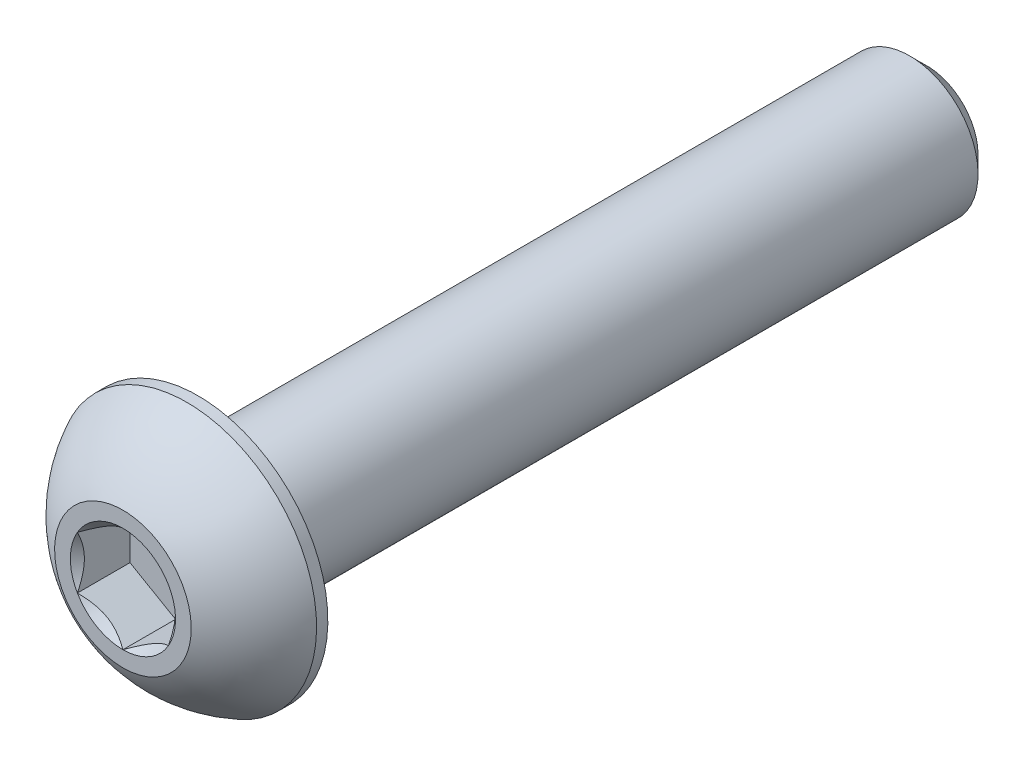
ISO-10303-21;
HEADER;
FILE_DESCRIPTION(('STEP AP214'),'2;1');
FILE_NAME('part.step','',(''),(''),'','','');
FILE_SCHEMA(('AUTOMOTIVE_DESIGN { 1 0 10303 214 1 1 1 1 }'));
ENDSEC;
DATA;
#1=APPLICATION_CONTEXT('core data for automotive mechanical design processes');
#2=APPLICATION_PROTOCOL_DEFINITION('international standard','automotive_design',2000,#1);
#3=PRODUCT_CONTEXT('',#1,'mechanical');
#4=PRODUCT('Part','Part','',(#3));
#5=PRODUCT_RELATED_PRODUCT_CATEGORY('part','',(#4));
#6=PRODUCT_DEFINITION_FORMATION('','',#4);
#7=PRODUCT_DEFINITION_CONTEXT('part definition',#1,'design');
#8=PRODUCT_DEFINITION('design','',#6,#7);
#9=PRODUCT_DEFINITION_SHAPE('','',#8);
#10=(LENGTH_UNIT() NAMED_UNIT(*) SI_UNIT(.MILLI.,.METRE.));
#11=(NAMED_UNIT(*) PLANE_ANGLE_UNIT() SI_UNIT($,.RADIAN.));
#12=(NAMED_UNIT(*) SI_UNIT($,.STERADIAN.) SOLID_ANGLE_UNIT());
#13=UNCERTAINTY_MEASURE_WITH_UNIT(LENGTH_MEASURE(1.E-05),#10,'distance_accuracy_value','');
#14=(GEOMETRIC_REPRESENTATION_CONTEXT(3) GLOBAL_UNCERTAINTY_ASSIGNED_CONTEXT((#13)) GLOBAL_UNIT_ASSIGNED_CONTEXT((#10,
#11,#12)) REPRESENTATION_CONTEXT('',''));
#15=CARTESIAN_POINT('',(0.,0.,0.));
#16=DIRECTION('',(0.,0.,1.));
#17=DIRECTION('',(1.,0.,0.));
#18=AXIS2_PLACEMENT_3D('',#15,#16,#17);
#19=CARTESIAN_POINT('',(0.,0.,-8.));
#20=DIRECTION('',(0.,0.,1.));
#21=DIRECTION('',(0.,-1.,0.));
#22=AXIS2_PLACEMENT_3D('',#19,#20,#21);
#23=PLANE('',#22);
#24=CARTESIAN_POINT('',(0.,0.,-8.));
#25=DIRECTION('',(0.,0.,1.));
#26=DIRECTION('',(0.,-1.,0.));
#27=AXIS2_PLACEMENT_3D('',#24,#25,#26);
#28=CIRCLE('',#27,1.12499999999998);
#29=CARTESIAN_POINT('',(0.,-1.12499999999997,-8.));
#30=VERTEX_POINT('',#29);
#31=EDGE_CURVE('E57',#30,#30,#28,.T.);
#32=ORIENTED_EDGE('',*,*,#31,.F.);
#33=EDGE_LOOP('',(#32));
#34=FACE_BOUND('',#33,.T.);
#35=ADVANCED_FACE('F43',(#34),#23,.F.);
#36=CARTESIAN_POINT('',(0.,0.,-8.));
#37=DIRECTION('',(0.,0.,1.));
#38=DIRECTION('',(0.,-1.,0.));
#39=AXIS2_PLACEMENT_3D('',#36,#37,#38);
#40=CONICAL_SURFACE('',#39,1.12499999999998,0.785398163397446);
#41=CARTESIAN_POINT('',(0.,0.,-7.625));
#42=DIRECTION('',(0.,0.,1.));
#43=DIRECTION('',(0.,-1.,0.));
#44=AXIS2_PLACEMENT_3D('',#41,#42,#43);
#45=CIRCLE('',#44,1.49999999999998);
#46=CARTESIAN_POINT('',(0.,-1.49999999999997,-7.625));
#47=VERTEX_POINT('',#46);
#48=EDGE_CURVE('E207',#47,#47,#45,.T.);
#49=ORIENTED_EDGE('',*,*,#48,.F.);
#50=EDGE_LOOP('',(#49));
#51=FACE_BOUND('',#50,.T.);
#52=ORIENTED_EDGE('',*,*,#31,.T.);
#53=EDGE_LOOP('',(#52));
#54=FACE_BOUND('',#53,.T.);
#55=ADVANCED_FACE('F214',(#51,#54),#40,.T.);
#56=CARTESIAN_POINT('',(0.,0.,9.65));
#57=DIRECTION('',(0.,0.,1.));
#58=DIRECTION('',(0.,-1.,0.));
#59=AXIS2_PLACEMENT_3D('',#56,#57,#58);
#60=CYLINDRICAL_SURFACE('',#59,1.49999999999999);
#61=CARTESIAN_POINT('',(0.,0.,8.));
#62=DIRECTION('',(0.,0.,1.));
#63=DIRECTION('',(0.,-1.,0.));
#64=AXIS2_PLACEMENT_3D('',#61,#62,#63);
#65=CIRCLE('',#64,1.5);
#66=CARTESIAN_POINT('',(0.,-1.5,8.));
#67=VERTEX_POINT('',#66);
#68=EDGE_CURVE('E203',#67,#67,#65,.T.);
#69=ORIENTED_EDGE('',*,*,#68,.F.);
#70=EDGE_LOOP('',(#69));
#71=FACE_BOUND('',#70,.T.);
#72=ORIENTED_EDGE('',*,*,#48,.T.);
#73=EDGE_LOOP('',(#72));
#74=FACE_BOUND('',#73,.T.);
#75=ADVANCED_FACE('F220',(#71,#74),#60,.T.);
#76=CARTESIAN_POINT('',(0.,-2.85000000000001,8.));
#77=DIRECTION('',(0.,0.,1.));
#78=DIRECTION('',(0.,-1.,0.));
#79=AXIS2_PLACEMENT_3D('',#76,#77,#78);
#80=PLANE('',#79);
#81=CARTESIAN_POINT('',(0.,0.,8.));
#82=DIRECTION('',(0.,0.,1.));
#83=DIRECTION('',(0.,-1.,0.));
#84=AXIS2_PLACEMENT_3D('',#81,#82,#83);
#85=CIRCLE('',#84,2.85000000000001);
#86=CARTESIAN_POINT('',(0.,-2.85000000000001,8.));
#87=VERTEX_POINT('',#86);
#88=EDGE_CURVE('E195',#87,#87,#85,.T.);
#89=ORIENTED_EDGE('',*,*,#88,.F.);
#90=EDGE_LOOP('',(#89));
#91=FACE_BOUND('',#90,.T.);
#92=ORIENTED_EDGE('',*,*,#68,.T.);
#93=EDGE_LOOP('',(#92));
#94=FACE_BOUND('',#93,.T.);
#95=ADVANCED_FACE('F225',(#91,#94),#80,.F.);
#96=CARTESIAN_POINT('',(0.,0.,6.85516711229947));
#97=DIRECTION('',(0.,0.,1.));
#98=DIRECTION('',(0.,-1.,0.));
#99=AXIS2_PLACEMENT_3D('',#96,#97,#98);
#100=SPHERICAL_SURFACE('',#99,3.17192226735973);
#101=CARTESIAN_POINT('',(0.,0.,9.65));
#102=DIRECTION('',(0.,0.,1.));
#103=DIRECTION('',(0.,-1.,0.));
#104=AXIS2_PLACEMENT_3D('',#101,#102,#103);
#105=CIRCLE('',#104,1.50000000000001);
#106=CARTESIAN_POINT('',(0.,-1.50000000000001,9.65));
#107=VERTEX_POINT('',#106);
#108=EDGE_CURVE('E199',#107,#107,#105,.T.);
#109=CARTESIAN_POINT('',(0.,0.,8.2475));
#110=DIRECTION('',(0.,0.,1.));
#111=DIRECTION('',(0.,-1.,0.));
#112=AXIS2_PLACEMENT_3D('',#109,#110,#111);
#113=CIRCLE('',#112,2.85000000000001);
#114=CARTESIAN_POINT('',(0.,-2.85000000000001,8.2475));
#115=VERTEX_POINT('',#114);
#116=EDGE_CURVE('E191',#115,#115,#113,.T.);
#117=CARTESIAN_POINT('',(0.,-1.50000000000001,9.65));
#118=CARTESIAN_POINT('',(0.,-1.51816007989211,9.64025343052663));
#119=CARTESIAN_POINT('',(0.,-1.53622513742981,9.63032981527615));
#120=CARTESIAN_POINT('',(0.,-1.57215840256595,9.61013236887069));
#121=CARTESIAN_POINT('',(0.,-1.59002661016438,9.59985853771571));
#122=CARTESIAN_POINT('',(0.,-1.62555937019151,9.57896453515098));
#123=CARTESIAN_POINT('',(0.,-1.6432239226202,9.56834436374123));
#124=CARTESIAN_POINT('',(0.,-1.67834266450263,9.54676172357303));
#125=CARTESIAN_POINT('',(0.,-1.69579685395636,9.53579925481459));
#126=CARTESIAN_POINT('',(0.,-1.73048823664555,9.51353618336439));
#127=CARTESIAN_POINT('',(0.,-1.74772542988099,9.50223558067265));
#128=CARTESIAN_POINT('',(0.,-1.78197627078177,9.47930053581285));
#129=CARTESIAN_POINT('',(0.,-1.7989899184471,9.46766609364478));
#130=CARTESIAN_POINT('',(0.,-1.83278720341136,9.44406779045309));
#131=CARTESIAN_POINT('',(0.,-1.84957084071029,9.43210392942946));
#132=CARTESIAN_POINT('',(0.,-1.88290172764637,9.40785133450125));
#133=CARTESIAN_POINT('',(0.,-1.89944897728351,9.39556260059666));
#134=CARTESIAN_POINT('',(0.,-1.9323008013937,9.37066492927458));
#135=CARTESIAN_POINT('',(0.,-1.94860537586674,9.35805599185708));
#136=CARTESIAN_POINT('',(0.,-1.98096565436366,9.33252270455889));
#137=CARTESIAN_POINT('',(0.,-1.99702135838754,9.31959835467819));
#138=CARTESIAN_POINT('',(0.,-2.02887779526297,9.29343915334777));
#139=CARTESIAN_POINT('',(0.,-2.04467852811453,9.28020430189805));
#140=CARTESIAN_POINT('',(0.,-2.07601901880465,9.25342912630669));
#141=CARTESIAN_POINT('',(0.,-2.09155877664322,9.23988880216506));
#142=CARTESIAN_POINT('',(0.,-2.12237141262986,9.21250782613789));
#143=CARTESIAN_POINT('',(0.,-2.13764429077793,9.19866717425237));
#144=CARTESIAN_POINT('',(0.,-2.16791736411297,9.17069080180173));
#145=CARTESIAN_POINT('',(0.,-2.18291755929994,9.15655508123662));
#146=CARTESIAN_POINT('',(0.,-2.21263956705415,9.12799394260905));
#147=CARTESIAN_POINT('',(0.,-2.2273613796214,9.11356852454658));
#148=CARTESIAN_POINT('',(0.,-2.25652102825521,9.08443347218353));
#149=CARTESIAN_POINT('',(0.,-2.27095886432178,9.06972383788295));
#150=CARTESIAN_POINT('',(0.,-2.29954507397651,9.04002594229721));
#151=CARTESIAN_POINT('',(0.,-2.31369344756466,9.02503768101205));
#152=CARTESIAN_POINT('',(0.,-2.34169535627253,8.99478822658124));
#153=CARTESIAN_POINT('',(0.,-2.35554889139224,8.97952703343559));
#154=CARTESIAN_POINT('',(0.,-2.38295585920367,8.94873751411442));
#155=CARTESIAN_POINT('',(0.,-2.39650929189538,8.93320918793889));
#156=CARTESIAN_POINT('',(0.,-2.42331090492183,8.90189130289176));
#157=CARTESIAN_POINT('',(0.,-2.43655908525657,8.88610174402014));
#158=CARTESIAN_POINT('',(0.,-2.46274515962756,8.85426739317577));
#159=CARTESIAN_POINT('',(0.,-2.4756830536638,8.83822260120302));
#160=CARTESIAN_POINT('',(0.,-2.50124363939651,8.80588388073287));
#161=CARTESIAN_POINT('',(0.,-2.51386633109299,8.78958995223548));
#162=CARTESIAN_POINT('',(0.,-2.5387917158728,8.7567591499574));
#163=CARTESIAN_POINT('',(0.,-2.55109440895613,8.74022227617671));
#164=CARTESIAN_POINT('',(0.,-2.57537512182786,8.70691186688636));
#165=CARTESIAN_POINT('',(0.,-2.58735314161626,8.69013833137669));
#166=CARTESIAN_POINT('',(0.,-2.61097995657957,8.65636097210575));
#167=CARTESIAN_POINT('',(0.,-2.62262875175449,8.63935714834448));
#168=CARTESIAN_POINT('',(0.,-2.645592691282,8.60512567355774));
#169=CARTESIAN_POINT('',(0.,-2.65690783563459,8.58789802253229));
#170=CARTESIAN_POINT('',(0.,-2.6792001740364,8.55322543922701));
#171=CARTESIAN_POINT('',(0.,-2.69017736808562,8.53578050694718));
#172=CARTESIAN_POINT('',(0.,-2.71178963499901,8.50067998980005));
#173=CARTESIAN_POINT('',(0.,-2.72242470786317,8.48302440493274));
#174=CARTESIAN_POINT('',(0.,-2.74334869082118,8.44750929096057));
#175=CARTESIAN_POINT('',(0.,-2.75363760091503,8.4296497618557));
#176=CARTESIAN_POINT('',(0.,-2.77386535089242,8.39373354659175));
#177=CARTESIAN_POINT('',(0.,-2.78380419077597,8.37567686043267));
#178=CARTESIAN_POINT('',(0.,-2.80332801615779,8.33937318815589));
#179=CARTESIAN_POINT('',(0.,-2.81291300165606,8.32112620203818));
#180=CARTESIAN_POINT('',(0.,-2.83172550494216,8.2844488779161));
#181=CARTESIAN_POINT('',(0.,-2.84095302272999,8.26601853991173));
#182=CARTESIAN_POINT('',(0.,-2.85000000000001,8.2475));
#183=B_SPLINE_CURVE_WITH_KNOTS('',3,(#117,#118,#119,#120,#121,#122,#123,#124,#125,#126,#127,
#128,#129,#130,#131,#132,#133,#134,#135,#136,#137,#138,#139,#140,#141,#142,#143,#144,#145,#146,
#147,#148,#149,#150,#151,#152,#153,#154,#155,#156,#157,#158,#159,#160,#161,#162,#163,#164,#165,
#166,#167,#168,#169,#170,#171,#172,#173,#174,#175,#176,#177,#178,#179,#180,#181,#182),
.UNSPECIFIED.,.F.,.F.,(4,2,2,2,2,2,2,2,2,2,2,2,2,2,2,2,2,2,2,2,2,2,2,2,2,2,2,2,2,2,2,2,4),(0.,
0.0618298941826991,0.123659788365397,0.185489682548095,0.247319576730794,0.309149470913492,
0.37097936509619,0.432809259278889,0.494639153461587,0.556469047644286,0.618298941826984,
0.680128836009683,0.741958730192381,0.80378862437508,0.865618518557778,0.927448412740476,
0.989278306923174,1.05110820110587,1.11293809528857,1.17476798947127,1.23659788365397,
1.29842777783667,1.36025767201936,1.42208756620206,1.48391746038476,1.54574735456746,
1.60757724875016,1.66940714293286,1.73123703711555,1.79306693129825,1.85489682548095,
1.91672671966365,1.97855661384635),.UNSPECIFIED.);
#184=EDGE_CURVE('BSEAM230',#107,#115,#183,.T.);
#185=ORIENTED_EDGE('',*,*,#108,.F.);
#186=ORIENTED_EDGE('',*,*,#116,.T.);
#187=ORIENTED_EDGE('',*,*,#184,.T.);
#188=ORIENTED_EDGE('',*,*,#184,.F.);
#189=EDGE_LOOP('',(#185,#187,#186,#188));
#190=FACE_BOUND('',#189,.T.);
#191=ADVANCED_FACE('F230',(#190),#100,.T.);
#192=CARTESIAN_POINT('',(0.,-1.50000000000001,9.65));
#193=DIRECTION('',(0.,0.,-1.));
#194=DIRECTION('',(0.,1.,0.));
#195=AXIS2_PLACEMENT_3D('',#192,#193,#194);
#196=PLANE('',#195);
#197=CARTESIAN_POINT('',(0.,0.,9.65));
#198=DIRECTION('',(0.,0.,1.));
#199=DIRECTION('',(1.,0.,0.));
#200=AXIS2_PLACEMENT_3D('',#197,#198,#199);
#201=CIRCLE('',#200,1.15470053837926);
#202=CARTESIAN_POINT('',(0.,1.15470053837925,9.65));
#203=VERTEX_POINT('',#202);
#204=CARTESIAN_POINT('',(-1.00000000000001,0.577350269189621,9.65));
#205=VERTEX_POINT('',#204);
#206=EDGE_CURVE('E148',#203,#205,#201,.T.);
#207=ORIENTED_EDGE('',*,*,#206,.F.);
#208=CARTESIAN_POINT('',(1.00000000000001,0.577350269189622,9.65));
#209=VERTEX_POINT('',#208);
#210=EDGE_CURVE('E143',#209,#203,#201,.T.);
#211=ORIENTED_EDGE('',*,*,#210,.F.);
#212=CARTESIAN_POINT('',(1.00000000000001,-0.577350269189636,9.65));
#213=VERTEX_POINT('',#212);
#214=EDGE_CURVE('E111',#213,#209,#201,.T.);
#215=ORIENTED_EDGE('',*,*,#214,.F.);
#216=CARTESIAN_POINT('',(0.,-1.15470053837927,9.65));
#217=VERTEX_POINT('',#216);
#218=EDGE_CURVE('E102',#217,#213,#201,.T.);
#219=ORIENTED_EDGE('',*,*,#218,.F.);
#220=CARTESIAN_POINT('',(-1.00000000000001,-0.577350269189636,9.65));
#221=VERTEX_POINT('',#220);
#222=EDGE_CURVE('E63',#221,#217,#201,.T.);
#223=ORIENTED_EDGE('',*,*,#222,.F.);
#224=EDGE_CURVE('E70',#205,#221,#201,.T.);
#225=ORIENTED_EDGE('',*,*,#224,.F.);
#226=EDGE_LOOP('',(#207,#211,#215,#219,#223,#225));
#227=FACE_BOUND('',#226,.T.);
#228=ORIENTED_EDGE('',*,*,#108,.T.);
#229=EDGE_LOOP('',(#228));
#230=FACE_BOUND('',#229,.T.);
#231=ADVANCED_FACE('F140',(#227,#230),#196,.F.);
#232=CARTESIAN_POINT('',(0.,0.,9.65));
#233=DIRECTION('',(0.,0.,1.));
#234=DIRECTION('',(0.,-1.,0.));
#235=AXIS2_PLACEMENT_3D('',#232,#233,#234);
#236=CYLINDRICAL_SURFACE('',#235,2.85000000000001);
#237=ORIENTED_EDGE('',*,*,#116,.F.);
#238=EDGE_LOOP('',(#237));
#239=FACE_BOUND('',#238,.T.);
#240=ORIENTED_EDGE('',*,*,#88,.T.);
#241=EDGE_LOOP('',(#240));
#242=FACE_BOUND('',#241,.T.);
#243=ADVANCED_FACE('F236',(#239,#242),#236,.T.);
#244=CARTESIAN_POINT('',(0.,0.,9.65));
#245=DIRECTION('',(0.,0.,1.));
#246=DIRECTION('',(1.,0.,0.));
#247=AXIS2_PLACEMENT_3D('',#244,#245,#246);
#248=CONICAL_SURFACE('',#247,1.15470053837926,0.78539816339745);
#249=ORIENTED_EDGE('',*,*,#214,.T.);
#250=CARTESIAN_POINT('',(1.00000000000001,-1.15147208663216,10.0203856776404));
#251=CARTESIAN_POINT('',(1.00000000000001,-1.12343448004837,9.99921991999533));
#252=CARTESIAN_POINT('',(1.00000000000001,-1.0952406486651,9.97826169229267));
#253=CARTESIAN_POINT('',(1.00000000000001,-1.03847715659241,9.93684602234268));
#254=CARTESIAN_POINT('',(1.00000000000001,-1.00990740397364,9.91638870622588));
#255=CARTESIAN_POINT('',(1.00000000000001,-0.923120894462788,9.85560479504213));
#256=CARTESIAN_POINT('',(1.00000000000001,-0.864253173878458,9.81619222903933));
#257=CARTESIAN_POINT('',(1.00000000000001,-0.740809858355824,9.73882066425819));
#258=CARTESIAN_POINT('',(1.00000000000001,-0.676100255223821,9.70107303916216));
#259=CARTESIAN_POINT('',(1.00000000000001,-0.543448939110608,9.63202458758025));
#260=CARTESIAN_POINT('',(1.00000000000001,-0.475519112076506,9.60070202786713));
#261=CARTESIAN_POINT('',(1.00000000000001,-0.373555850372658,9.5623817788976));
#262=CARTESIAN_POINT('',(1.00000000000001,-0.341031989714056,9.55138359165622));
#263=CARTESIAN_POINT('',(1.00000000000001,-0.275199079103611,9.53199834216111));
#264=CARTESIAN_POINT('',(1.00000000000001,-0.241889975229401,9.52361145978989));
#265=CARTESIAN_POINT('',(1.00000000000001,-0.175247517106624,9.51002522073014));
#266=CARTESIAN_POINT('',(1.00000000000001,-0.141925568285816,9.50477079077761));
#267=CARTESIAN_POINT('',(1.00000000000001,-0.0749144363078094,9.49754868657667));
#268=CARTESIAN_POINT('',(1.00000000000001,-0.0412251979295709,9.49558151361391));
#269=CARTESIAN_POINT('',(1.00000000000001,0.0249580991768566,9.49508319839111));
#270=CARTESIAN_POINT('',(1.00000000000001,0.0574512825561883,9.49643026788357));
#271=CARTESIAN_POINT('',(1.00000000000001,0.122148505605771,9.50221648448742));
#272=CARTESIAN_POINT('',(1.00000000000001,0.154352610033873,9.50665492064649));
#273=CARTESIAN_POINT('',(1.00000000000001,0.218799898762748,9.51845683012285));
#274=CARTESIAN_POINT('',(1.00000000000001,0.25103374316119,9.52587054101231));
#275=CARTESIAN_POINT('',(1.00000000000001,0.314797132241688,9.54322894246471));
#276=CARTESIAN_POINT('',(1.00000000000001,0.346326735615178,9.55317342125094));
#277=CARTESIAN_POINT('',(1.00000000000001,0.445594187589159,9.58822348249794));
#278=CARTESIAN_POINT('',(1.00000000000001,0.51191913931363,9.6173208582833));
#279=CARTESIAN_POINT('',(1.00000000000001,0.641453244454046,9.68201532957715));
#280=CARTESIAN_POINT('',(1.00000000000001,0.704650132903148,9.71763577658696));
#281=CARTESIAN_POINT('',(1.00000000000001,0.825428489916352,9.79112390118245));
#282=CARTESIAN_POINT('',(1.00000000000001,0.883132947593197,9.82879194695385));
#283=CARTESIAN_POINT('',(1.00000000000001,0.968148853406637,9.88702285273595));
#284=CARTESIAN_POINT('',(1.00000000000001,0.996120570074655,9.90663847554718));
#285=CARTESIAN_POINT('',(1.00000000000001,1.05168177697803,9.94638851682867));
#286=CARTESIAN_POINT('',(1.00000000000001,1.07927136964837,9.96652279195778));
#287=CARTESIAN_POINT('',(1.00000000000001,1.10670185312702,9.98687211882347));
#288=B_SPLINE_CURVE_WITH_KNOTS('',3,(#250,#251,#252,#253,#254,#255,#256,#257,#258,#259,#260,
#261,#262,#263,#264,#265,#266,#267,#268,#269,#270,#271,#272,#273,#274,#275,#276,#277,#278,#279,
#280,#281,#282,#283,#284,#285,#286,#287),.UNSPECIFIED.,.F.,.F.,(4,2,2,2,2,2,2,2,2,2,2,2,2,2,2,2,
2,2,4),(0.,0.105386459103352,0.21079918737025,0.423233611646474,0.647793541035355,
0.87158087791087,0.97449307434206,1.07741235842105,1.17846428216996,1.2795316142844,
1.3769408675127,1.47432772596048,1.57343322813836,1.67253043981297,1.88917353997387,
2.10660791031435,2.31323734235673,2.41572589214524,2.51818641455634),.UNSPECIFIED.);
#289=EDGE_CURVE('E11',#213,#209,#288,.T.);
#290=ORIENTED_EDGE('',*,*,#289,.F.);
#291=EDGE_LOOP('',(#249,#290));
#292=FACE_BOUND('',#291,.T.);
#293=ADVANCED_FACE('F115',(#292),#248,.F.);
#294=ORIENTED_EDGE('',*,*,#210,.T.);
#295=CARTESIAN_POINT('',(1.00020000000001,0.577234799135784,9.65011548737261));
#296=CARTESIAN_POINT('',(0.965817404992825,0.597085599618617,9.63027793082573));
#297=CARTESIAN_POINT('',(0.930859881860181,0.617268335009452,9.61160502063889));
#298=CARTESIAN_POINT('',(0.859577197043916,0.658423412276682,9.57741474272316));
#299=CARTESIAN_POINT('',(0.823245249471021,0.679399671988076,9.56191640902346));
#300=CARTESIAN_POINT('',(0.749983386196693,0.721697428470842,9.53536730714226));
#301=CARTESIAN_POINT('',(0.71307214855459,0.743008141459633,9.52424977399693));
#302=CARTESIAN_POINT('',(0.638437270689145,0.786098608286183,9.50711986577618));
#303=CARTESIAN_POINT('',(0.600715911891368,0.807877044942278,9.50109469746667));
#304=CARTESIAN_POINT('',(0.53570780158207,0.84540949492886,9.49566055496749));
#305=CARTESIAN_POINT('',(0.508505628471831,0.861114676896599,9.49485693831673));
#306=CARTESIAN_POINT('',(0.454153959330891,0.892494627706026,9.49620669941689));
#307=CARTESIAN_POINT('',(0.427004476245127,0.908169389073951,9.4983607295472));
#308=CARTESIAN_POINT('',(0.345943722673042,0.954969836969508,9.50911697212847));
#309=CARTESIAN_POINT('',(0.292435859021575,0.985862616452445,9.52201455641536));
#310=CARTESIAN_POINT('',(0.19852393485657,1.04008269114923,9.55314073060218));
#311=CARTESIAN_POINT('',(0.157679476328166,1.0636642502755,9.56973779770184));
#312=CARTESIAN_POINT('',(0.0775903626180564,1.10990372163519,9.60712492468529));
#313=CARTESIAN_POINT('',(0.0383409891295622,1.1325643579843,9.6279013418174));
#314=CARTESIAN_POINT('',(-0.000200000000000446,1.15481600843309,9.65011548737261));
#315=B_SPLINE_CURVE_WITH_KNOTS('',3,(#295,#296,#297,#298,#299,#300,#301,#302,#303,#304,#305,
#306,#307,#308,#309,#310,#311,#312,#313,#314),.UNSPECIFIED.,.F.,.F.,(4,2,2,2,2,2,2,2,2,4),(0.,
0.133237676828559,0.267252229834491,0.399137076269302,0.530689603280771,0.624814864263849,
0.718960890149137,0.907306626112102,1.0571010036179,1.20641411519287),.UNSPECIFIED.);
#316=EDGE_CURVE('E147',#209,#203,#315,.T.);
#317=ORIENTED_EDGE('',*,*,#316,.F.);
#318=EDGE_LOOP('',(#294,#317));
#319=FACE_BOUND('',#318,.T.);
#320=ADVANCED_FACE('F323',(#319),#248,.F.);
#321=ORIENTED_EDGE('',*,*,#206,.T.);
#322=CARTESIAN_POINT('',(0.000199999999999627,1.15481600843309,9.65011548737261));
#323=CARTESIAN_POINT('',(-0.034182595007181,1.13496520795025,9.63027793082573));
#324=CARTESIAN_POINT('',(-0.0691401181398251,1.11478247255942,9.61160502063889));
#325=CARTESIAN_POINT('',(-0.14042280295609,1.07362739529219,9.57741474272316));
#326=CARTESIAN_POINT('',(-0.176754750528985,1.0526511355808,9.56191640902346));
#327=CARTESIAN_POINT('',(-0.250016613803312,1.01035337909803,9.53536730714226));
#328=CARTESIAN_POINT('',(-0.286927851445416,0.989042666109239,9.52424977399693));
#329=CARTESIAN_POINT('',(-0.361562729310861,0.945952199282689,9.50711986577618));
#330=CARTESIAN_POINT('',(-0.399284088108637,0.924173762626594,9.50109469746667));
#331=CARTESIAN_POINT('',(-0.464292198417936,0.886641312640012,9.49566055496749));
#332=CARTESIAN_POINT('',(-0.491494371528174,0.870936130672273,9.49485693831673));
#333=CARTESIAN_POINT('',(-0.545846040669114,0.839556179862846,9.49620669941689));
#334=CARTESIAN_POINT('',(-0.572995523754878,0.823881418494921,9.4983607295472));
#335=CARTESIAN_POINT('',(-0.654056277326963,0.777080970599364,9.50911697212847));
#336=CARTESIAN_POINT('',(-0.70756414097843,0.746188191116427,9.52201455641536));
#337=CARTESIAN_POINT('',(-0.801476065143435,0.691968116419646,9.55314073060218));
#338=CARTESIAN_POINT('',(-0.842320523671839,0.668386557293368,9.56973779770184));
#339=CARTESIAN_POINT('',(-0.922409637381949,0.622147085933677,9.60712492468529));
#340=CARTESIAN_POINT('',(-0.961659010870444,0.59948644958457,9.6279013418174));
#341=CARTESIAN_POINT('',(-1.00020000000001,0.577234799135783,9.65011548737261));
#342=B_SPLINE_CURVE_WITH_KNOTS('',3,(#322,#323,#324,#325,#326,#327,#328,#329,#330,#331,#332,
#333,#334,#335,#336,#337,#338,#339,#340,#341),.UNSPECIFIED.,.F.,.F.,(4,2,2,2,2,2,2,2,2,4),(0.,
0.133237676828559,0.267252229834491,0.399137076269301,0.53068960328077,0.624814864263848,
0.718960890149135,0.907306626112101,1.0571010036179,1.20641411519287),.UNSPECIFIED.);
#343=EDGE_CURVE('E153',#203,#205,#342,.T.);
#344=ORIENTED_EDGE('',*,*,#343,.F.);
#345=EDGE_LOOP('',(#321,#344));
#346=FACE_BOUND('',#345,.T.);
#347=ADVANCED_FACE('F158',(#346),#248,.F.);
#348=ORIENTED_EDGE('',*,*,#224,.T.);
#349=CARTESIAN_POINT('',(-1.00000000000001,-1.15147208646463,10.0203856775139));
#350=CARTESIAN_POINT('',(-1.00000000000001,-1.12343447988553,9.99921991987372));
#351=CARTESIAN_POINT('',(-1.00000000000001,-1.09524064850699,9.97826169217591));
#352=CARTESIAN_POINT('',(-1.00000000000001,-1.03847715644378,9.93684602223562));
#353=CARTESIAN_POINT('',(-1.00000000000001,-1.00990740382976,9.91638870612366));
#354=CARTESIAN_POINT('',(-1.00000000000001,-0.92312089433349,9.85560479495451));
#355=CARTESIAN_POINT('',(-1.00000000000001,-0.864253173759073,9.8161922289614));
#356=CARTESIAN_POINT('',(-1.00000000000001,-0.740809858258058,9.73882066420021));
#357=CARTESIAN_POINT('',(-1.00000000000001,-0.676100255137819,9.70107303911434));
#358=CARTESIAN_POINT('',(-1.00000000000001,-0.543448939049135,9.63202458755129));
#359=CARTESIAN_POINT('',(-1.00000000000001,-0.475519112027789,9.60070202784687));
#360=CARTESIAN_POINT('',(-1.00000000000001,-0.373555850333539,9.5623817788838));
#361=CARTESIAN_POINT('',(-1.00000000000001,-0.341031989670918,9.55138359164216));
#362=CARTESIAN_POINT('',(-1.00000000000001,-0.275199079052303,9.53199834214736));
#363=CARTESIAN_POINT('',(-1.00000000000001,-0.241889975173942,9.5236114597767));
#364=CARTESIAN_POINT('',(-1.00000000000001,-0.175247517043001,9.51002522071902));
#365=CARTESIAN_POINT('',(-1.00000000000001,-0.141925568218183,9.50477079076797));
#366=CARTESIAN_POINT('',(-1.00000000000001,-0.0749144362322863,9.49754868657089));
#367=CARTESIAN_POINT('',(-1.00000000000001,-0.0412251978501688,9.49558151361051));
#368=CARTESIAN_POINT('',(-1.00000000000001,0.0249580992634145,9.49508319839316));
#369=CARTESIAN_POINT('',(-1.00000000000001,0.0574512826460329,9.49643026788864));
#370=CARTESIAN_POINT('',(-1.00000000000001,0.122148505701861,9.50221648449899));
#371=CARTESIAN_POINT('',(-1.00000000000001,0.154352610132921,9.50665492066153));
#372=CARTESIAN_POINT('',(-1.00000000000001,0.218799898867634,9.5184568301452));
#373=CARTESIAN_POINT('',(-1.00000000000001,0.251033743268948,9.52587054103851));
#374=CARTESIAN_POINT('',(-1.00000000000001,0.314797132354914,9.54322894249868));
#375=CARTESIAN_POINT('',(-1.00000000000001,0.346326735730999,9.55317342128883));
#376=CARTESIAN_POINT('',(-1.00000000000001,0.445594187730201,9.58822348255434));
#377=CARTESIAN_POINT('',(-1.00000000000001,0.511919139476033,9.61732085835672));
#378=CARTESIAN_POINT('',(-1.00000000000001,0.64145324465753,9.68201532968651));
#379=CARTESIAN_POINT('',(-1.00000000000001,0.704650133126342,9.71763577671524));
#380=CARTESIAN_POINT('',(-1.00000000000001,0.825428490174986,9.79112390134694));
#381=CARTESIAN_POINT('',(-1.00000000000001,0.883132947867684,9.82879194713547));
#382=CARTESIAN_POINT('',(-1.00000000000001,0.968148853704566,9.88702285294316));
#383=CARTESIAN_POINT('',(-1.00000000000001,0.996120570380285,9.90663847576286));
#384=CARTESIAN_POINT('',(-1.00000000000001,1.05168177729901,9.94638851706127));
#385=CARTESIAN_POINT('',(-1.00000000000001,1.079271369977,9.96652279219883));
#386=CARTESIAN_POINT('',(-1.00000000000001,1.10670185346329,9.98687211907297));
#387=B_SPLINE_CURVE_WITH_KNOTS('',3,(#349,#350,#351,#352,#353,#354,#355,#356,#357,#358,#359,
#360,#361,#362,#363,#364,#365,#366,#367,#368,#369,#370,#371,#372,#373,#374,#375,#376,#377,#378,
#379,#380,#381,#382,#383,#384,#385,#386),.UNSPECIFIED.,.F.,.F.,(4,2,2,2,2,2,2,2,2,2,2,2,2,2,2,2,
2,2,4),(0.,0.105386459083291,0.210799187330125,0.423233611565472,0.647793540908508,
0.871580877738615,0.974493074181427,1.07741235827202,1.17846428203205,1.27953161415763,
1.37694086739611,1.47432772585409,1.57343322804294,1.67253043972852,1.88917353996828,
2.10660791038814,2.31323734249845,2.41572589232046,2.51818641476505),.UNSPECIFIED.);
#388=EDGE_CURVE('E161',#205,#221,#387,.F.);
#389=ORIENTED_EDGE('',*,*,#388,.F.);
#390=EDGE_LOOP('',(#348,#389));
#391=FACE_BOUND('',#390,.T.);
#392=ADVANCED_FACE('F162',(#391),#248,.F.);
#393=ORIENTED_EDGE('',*,*,#222,.T.);
#394=CARTESIAN_POINT('',(-1.00020000000001,-0.5772347991358,9.65011548737261));
#395=CARTESIAN_POINT('',(-0.965817404992825,-0.597085599618633,9.63027793082573));
#396=CARTESIAN_POINT('',(-0.930859881860181,-0.617268335009468,9.61160502063889));
#397=CARTESIAN_POINT('',(-0.859577197043916,-0.658423412276698,9.57741474272316));
#398=CARTESIAN_POINT('',(-0.823245249471021,-0.679399671988092,9.56191640902346));
#399=CARTESIAN_POINT('',(-0.749983386196693,-0.721697428470859,9.53536730714227));
#400=CARTESIAN_POINT('',(-0.71307214855459,-0.74300814145965,9.52424977399693));
#401=CARTESIAN_POINT('',(-0.638437270689144,-0.786098608286199,9.50711986577618));
#402=CARTESIAN_POINT('',(-0.600715911891367,-0.807877044942294,9.50109469746667));
#403=CARTESIAN_POINT('',(-0.535707801582069,-0.845409494928876,9.49566055496749));
#404=CARTESIAN_POINT('',(-0.50850562847183,-0.861114676896615,9.49485693831673));
#405=CARTESIAN_POINT('',(-0.45415395933089,-0.892494627706043,9.49620669941689));
#406=CARTESIAN_POINT('',(-0.427004476245126,-0.908169389073968,9.4983607295472));
#407=CARTESIAN_POINT('',(-0.345943722673041,-0.954969836969525,9.50911697212847));
#408=CARTESIAN_POINT('',(-0.292435859021574,-0.985862616452461,9.52201455641536));
#409=CARTESIAN_POINT('',(-0.198523934856569,-1.04008269114924,9.55314073060218));
#410=CARTESIAN_POINT('',(-0.157679476328166,-1.06366425027552,9.56973779770184));
#411=CARTESIAN_POINT('',(-0.0775903626180565,-1.10990372163521,9.60712492468529));
#412=CARTESIAN_POINT('',(-0.0383409891295621,-1.13256435798432,9.6279013418174));
#413=CARTESIAN_POINT('',(0.000200000000000331,-1.1548160084331,9.65011548737261));
#414=B_SPLINE_CURVE_WITH_KNOTS('',3,(#394,#395,#396,#397,#398,#399,#400,#401,#402,#403,#404,
#405,#406,#407,#408,#409,#410,#411,#412,#413),.UNSPECIFIED.,.F.,.F.,(4,2,2,2,2,2,2,2,2,4),(0.,
0.13323767682856,0.267252229834493,0.399137076269303,0.530689603280772,0.62481486426385,
0.718960890149138,0.907306626112104,1.0571010036179,1.20641411519287),.UNSPECIFIED.);
#415=EDGE_CURVE('E128',#221,#217,#414,.T.);
#416=ORIENTED_EDGE('',*,*,#415,.F.);
#417=EDGE_LOOP('',(#393,#416));
#418=FACE_BOUND('',#417,.T.);
#419=ADVANCED_FACE('F264',(#418),#248,.F.);
#420=ORIENTED_EDGE('',*,*,#218,.T.);
#421=CARTESIAN_POINT('',(-0.000199999999999361,-1.1548160084331,9.65011548737261));
#422=CARTESIAN_POINT('',(0.0341825950071819,-1.13496520795027,9.63027793082574));
#423=CARTESIAN_POINT('',(0.0691401181398261,-1.11478247255944,9.61160502063889));
#424=CARTESIAN_POINT('',(0.140422802956091,-1.07362739529221,9.57741474272316));
#425=CARTESIAN_POINT('',(0.176754750528986,-1.05265113558081,9.56191640902346));
#426=CARTESIAN_POINT('',(0.250016613803314,-1.01035337909805,9.53536730714226));
#427=CARTESIAN_POINT('',(0.286927851445418,-0.989042666109254,9.52424977399693));
#428=CARTESIAN_POINT('',(0.361562729310863,-0.945952199282704,9.50711986577618));
#429=CARTESIAN_POINT('',(0.39928408810864,-0.92417376262661,9.50109469746667));
#430=CARTESIAN_POINT('',(0.464292198417938,-0.886641312640027,9.49566055496749));
#431=CARTESIAN_POINT('',(0.491494371528177,-0.870936130672288,9.49485693831673));
#432=CARTESIAN_POINT('',(0.545846040669117,-0.839556179862861,9.49620669941689));
#433=CARTESIAN_POINT('',(0.572995523754881,-0.823881418494936,9.4983607295472));
#434=CARTESIAN_POINT('',(0.654056277326966,-0.777080970599378,9.50911697212847));
#435=CARTESIAN_POINT('',(0.707564140978433,-0.746188191116442,9.52201455641536));
#436=CARTESIAN_POINT('',(0.801476065143438,-0.691968116419661,9.55314073060218));
#437=CARTESIAN_POINT('',(0.842320523671841,-0.668386557293383,9.56973779770184));
#438=CARTESIAN_POINT('',(0.92240963738195,-0.622147085933693,9.60712492468529));
#439=CARTESIAN_POINT('',(0.961659010870444,-0.599486449584586,9.6279013418174));
#440=CARTESIAN_POINT('',(1.00020000000001,-0.577234799135799,9.65011548737261));
#441=B_SPLINE_CURVE_WITH_KNOTS('',3,(#421,#422,#423,#424,#425,#426,#427,#428,#429,#430,#431,
#432,#433,#434,#435,#436,#437,#438,#439,#440),.UNSPECIFIED.,.F.,.F.,(4,2,2,2,2,2,2,2,2,4),(0.,
0.13323767682856,0.267252229834493,0.399137076269304,0.530689603280773,0.624814864263851,
0.718960890149139,0.907306626112105,1.0571010036179,1.20641411519287),.UNSPECIFIED.);
#442=EDGE_CURVE('E106',#217,#213,#441,.T.);
#443=ORIENTED_EDGE('',*,*,#442,.F.);
#444=EDGE_LOOP('',(#420,#443));
#445=FACE_BOUND('',#444,.T.);
#446=ADVANCED_FACE('F104',(#445),#248,.F.);
#447=CARTESIAN_POINT('',(1.00000000000001,-0.577350269189637,8.495));
#448=DIRECTION('',(0.,0.,1.));
#449=DIRECTION('',(1.,0.,0.));
#450=AXIS2_PLACEMENT_3D('',#447,#448,#449);
#451=PLANE('',#450);
#452=DIRECTION('',(0.866025403784438,0.5,0.));
#453=VECTOR('',#452,1.);
#454=CARTESIAN_POINT('',(0.,-1.15470053837927,8.495));
#455=LINE('',#454,#453);
#456=CARTESIAN_POINT('',(0.,-1.15470053837927,8.495));
#457=VERTEX_POINT('',#456);
#458=CARTESIAN_POINT('',(1.00000000000001,-0.577350269189637,8.495));
#459=VERTEX_POINT('',#458);
#460=EDGE_CURVE('E127',#457,#459,#455,.T.);
#461=ORIENTED_EDGE('',*,*,#460,.T.);
#462=DIRECTION('',(0.,1.,0.));
#463=VECTOR('',#462,1.);
#464=CARTESIAN_POINT('',(1.00000000000001,-0.577350269189637,8.495));
#465=LINE('',#464,#463);
#466=CARTESIAN_POINT('',(1.00000000000001,0.577350269189621,8.495));
#467=VERTEX_POINT('',#466);
#468=EDGE_CURVE('E132',#459,#467,#465,.T.);
#469=ORIENTED_EDGE('',*,*,#468,.T.);
#470=DIRECTION('',(-0.866025403784439,0.5,0.));
#471=VECTOR('',#470,1.);
#472=CARTESIAN_POINT('',(1.00000000000001,0.577350269189621,8.495));
#473=LINE('',#472,#471);
#474=CARTESIAN_POINT('',(0.,1.15470053837925,8.495));
#475=VERTEX_POINT('',#474);
#476=EDGE_CURVE('E298',#467,#475,#473,.T.);
#477=ORIENTED_EDGE('',*,*,#476,.T.);
#478=DIRECTION('',(-0.866025403784438,-0.5,0.));
#479=VECTOR('',#478,1.);
#480=CARTESIAN_POINT('',(0.,1.15470053837925,8.495));
#481=LINE('',#480,#479);
#482=CARTESIAN_POINT('',(-1.00000000000001,0.577350269189621,8.495));
#483=VERTEX_POINT('',#482);
#484=EDGE_CURVE('E301',#475,#483,#481,.T.);
#485=ORIENTED_EDGE('',*,*,#484,.T.);
#486=DIRECTION('',(0.,-1.,0.));
#487=VECTOR('',#486,1.);
#488=CARTESIAN_POINT('',(-1.00000000000001,0.577350269189621,8.495));
#489=LINE('',#488,#487);
#490=CARTESIAN_POINT('',(-1.00000000000001,-0.577350269189637,8.495));
#491=VERTEX_POINT('',#490);
#492=EDGE_CURVE('E178',#483,#491,#489,.T.);
#493=ORIENTED_EDGE('',*,*,#492,.T.);
#494=DIRECTION('',(0.866025403784439,-0.5,0.));
#495=VECTOR('',#494,1.);
#496=CARTESIAN_POINT('',(-1.00000000000001,-0.577350269189637,8.495));
#497=LINE('',#496,#495);
#498=EDGE_CURVE('E136',#491,#457,#497,.T.);
#499=ORIENTED_EDGE('',*,*,#498,.T.);
#500=EDGE_LOOP('',(#461,#469,#477,#485,#493,#499));
#501=FACE_BOUND('',#500,.T.);
#502=ADVANCED_FACE('F263',(#501),#451,.T.);
#503=CARTESIAN_POINT('',(1.00000000000001,-0.577350269189637,8.495));
#504=DIRECTION('',(1.,0.,0.));
#505=DIRECTION('',(0.,1.,0.));
#506=AXIS2_PLACEMENT_3D('',#503,#504,#505);
#507=PLANE('',#506);
#508=DIRECTION('',(0.,0.,1.));
#509=VECTOR('',#508,1.);
#510=CARTESIAN_POINT('',(1.00000000000001,-0.577350269189637,8.495));
#511=LINE('',#510,#509);
#512=EDGE_CURVE('E123',#459,#213,#511,.T.);
#513=ORIENTED_EDGE('',*,*,#512,.T.);
#514=ORIENTED_EDGE('',*,*,#289,.T.);
#515=DIRECTION('',(0.,0.,1.));
#516=VECTOR('',#515,1.);
#517=CARTESIAN_POINT('',(1.00000000000001,0.577350269189621,8.495));
#518=LINE('',#517,#516);
#519=EDGE_CURVE('E135',#467,#209,#518,.T.);
#520=ORIENTED_EDGE('',*,*,#519,.F.);
#521=ORIENTED_EDGE('',*,*,#468,.F.);
#522=EDGE_LOOP('',(#513,#514,#520,#521));
#523=FACE_BOUND('',#522,.T.);
#524=ADVANCED_FACE('F130',(#523),#507,.F.);
#525=CARTESIAN_POINT('',(1.00000000000001,0.577350269189621,8.495));
#526=DIRECTION('',(0.5,0.866025403784439,0.));
#527=DIRECTION('',(-0.866025403784439,0.5,0.));
#528=AXIS2_PLACEMENT_3D('',#525,#526,#527);
#529=PLANE('',#528);
#530=ORIENTED_EDGE('',*,*,#519,.T.);
#531=ORIENTED_EDGE('',*,*,#316,.T.);
#532=DIRECTION('',(0.,0.,1.));
#533=VECTOR('',#532,1.);
#534=CARTESIAN_POINT('',(0.,1.15470053837925,8.495));
#535=LINE('',#534,#533);
#536=EDGE_CURVE('E173',#475,#203,#535,.T.);
#537=ORIENTED_EDGE('',*,*,#536,.F.);
#538=ORIENTED_EDGE('',*,*,#476,.F.);
#539=EDGE_LOOP('',(#530,#531,#537,#538));
#540=FACE_BOUND('',#539,.T.);
#541=ADVANCED_FACE('F289',(#540),#529,.F.);
#542=CARTESIAN_POINT('',(0.,1.15470053837925,8.495));
#543=DIRECTION('',(-0.5,0.866025403784439,0.));
#544=DIRECTION('',(-0.866025403784439,-0.5,0.));
#545=AXIS2_PLACEMENT_3D('',#542,#543,#544);
#546=PLANE('',#545);
#547=ORIENTED_EDGE('',*,*,#536,.T.);
#548=ORIENTED_EDGE('',*,*,#343,.T.);
#549=DIRECTION('',(0.,0.,1.));
#550=VECTOR('',#549,1.);
#551=CARTESIAN_POINT('',(-1.00000000000001,0.577350269189621,8.495));
#552=LINE('',#551,#550);
#553=EDGE_CURVE('E171',#483,#205,#552,.T.);
#554=ORIENTED_EDGE('',*,*,#553,.F.);
#555=ORIENTED_EDGE('',*,*,#484,.F.);
#556=EDGE_LOOP('',(#547,#548,#554,#555));
#557=FACE_BOUND('',#556,.T.);
#558=ADVANCED_FACE('F169',(#557),#546,.F.);
#559=CARTESIAN_POINT('',(-1.00000000000001,0.577350269189621,8.495));
#560=DIRECTION('',(-1.,0.,0.));
#561=DIRECTION('',(0.,0.,1.));
#562=AXIS2_PLACEMENT_3D('',#559,#560,#561);
#563=PLANE('',#562);
#564=ORIENTED_EDGE('',*,*,#553,.T.);
#565=ORIENTED_EDGE('',*,*,#388,.T.);
#566=DIRECTION('',(0.,0.,1.));
#567=VECTOR('',#566,1.);
#568=CARTESIAN_POINT('',(-1.00000000000001,-0.577350269189637,8.495));
#569=LINE('',#568,#567);
#570=EDGE_CURVE('E181',#491,#221,#569,.T.);
#571=ORIENTED_EDGE('',*,*,#570,.F.);
#572=ORIENTED_EDGE('',*,*,#492,.F.);
#573=EDGE_LOOP('',(#564,#565,#571,#572));
#574=FACE_BOUND('',#573,.T.);
#575=ADVANCED_FACE('F176',(#574),#563,.F.);
#576=CARTESIAN_POINT('',(-1.00000000000001,-0.577350269189637,8.495));
#577=DIRECTION('',(-0.5,-0.866025403784439,0.));
#578=DIRECTION('',(0.866025403784439,-0.5,0.));
#579=AXIS2_PLACEMENT_3D('',#576,#577,#578);
#580=PLANE('',#579);
#581=ORIENTED_EDGE('',*,*,#570,.T.);
#582=ORIENTED_EDGE('',*,*,#415,.T.);
#583=DIRECTION('',(0.,0.,1.));
#584=VECTOR('',#583,1.);
#585=CARTESIAN_POINT('',(0.,-1.15470053837927,8.495));
#586=LINE('',#585,#584);
#587=EDGE_CURVE('E125',#457,#217,#586,.T.);
#588=ORIENTED_EDGE('',*,*,#587,.F.);
#589=ORIENTED_EDGE('',*,*,#498,.F.);
#590=EDGE_LOOP('',(#581,#582,#588,#589));
#591=FACE_BOUND('',#590,.T.);
#592=ADVANCED_FACE('F245',(#591),#580,.F.);
#593=CARTESIAN_POINT('',(0.,-1.15470053837927,8.495));
#594=DIRECTION('',(0.5,-0.866025403784438,0.));
#595=DIRECTION('',(0.866025403784438,0.5,0.));
#596=AXIS2_PLACEMENT_3D('',#593,#594,#595);
#597=PLANE('',#596);
#598=ORIENTED_EDGE('',*,*,#587,.T.);
#599=ORIENTED_EDGE('',*,*,#442,.T.);
#600=ORIENTED_EDGE('',*,*,#512,.F.);
#601=ORIENTED_EDGE('',*,*,#460,.F.);
#602=EDGE_LOOP('',(#598,#599,#600,#601));
#603=FACE_BOUND('',#602,.T.);
#604=ADVANCED_FACE('F121',(#603),#597,.F.);
#605=CLOSED_SHELL('',(#35,#55,#75,#95,#191,#231,#243,#293,#320,#347,#392,#419,#446,#502,#524,
#541,#558,#575,#592,#604));
#606=MANIFOLD_SOLID_BREP('B2',#605);
#607=ADVANCED_BREP_SHAPE_REPRESENTATION('',(#18,#606),#14);
#608=SHAPE_DEFINITION_REPRESENTATION(#9,#607);
ENDSEC;
END-ISO-10303-21;
